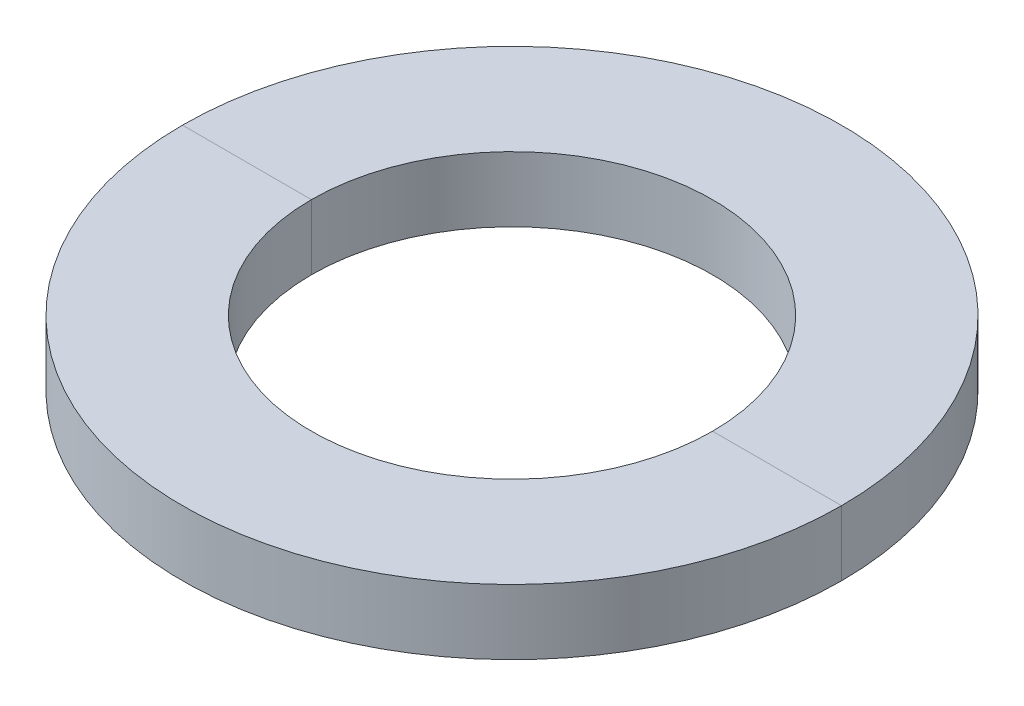
ISO-10303-21;
HEADER;
FILE_DESCRIPTION(('STEP AP214'),'2;1');
FILE_NAME('part.step','',(''),(''),'','','');
FILE_SCHEMA(('AUTOMOTIVE_DESIGN { 1 0 10303 214 1 1 1 1 }'));
ENDSEC;
DATA;
#1=APPLICATION_CONTEXT('core data for automotive mechanical design processes');
#2=APPLICATION_PROTOCOL_DEFINITION('international standard','automotive_design',2000,#1);
#3=PRODUCT_CONTEXT('',#1,'mechanical');
#4=PRODUCT('Part','Part','',(#3));
#5=PRODUCT_RELATED_PRODUCT_CATEGORY('part','',(#4));
#6=PRODUCT_DEFINITION_FORMATION('','',#4);
#7=PRODUCT_DEFINITION_CONTEXT('part definition',#1,'design');
#8=PRODUCT_DEFINITION('design','',#6,#7);
#9=PRODUCT_DEFINITION_SHAPE('','',#8);
#10=(LENGTH_UNIT() NAMED_UNIT(*) SI_UNIT(.MILLI.,.METRE.));
#11=(NAMED_UNIT(*) PLANE_ANGLE_UNIT() SI_UNIT($,.RADIAN.));
#12=(NAMED_UNIT(*) SI_UNIT($,.STERADIAN.) SOLID_ANGLE_UNIT());
#13=UNCERTAINTY_MEASURE_WITH_UNIT(LENGTH_MEASURE(1.E-05),#10,'distance_accuracy_value','');
#14=(GEOMETRIC_REPRESENTATION_CONTEXT(3) GLOBAL_UNCERTAINTY_ASSIGNED_CONTEXT((#13)) GLOBAL_UNIT_ASSIGNED_CONTEXT((#10,
#11,#12)) REPRESENTATION_CONTEXT('',''));
#15=CARTESIAN_POINT('',(0.,0.,0.));
#16=DIRECTION('',(0.,0.,1.));
#17=DIRECTION('',(1.,0.,0.));
#18=AXIS2_PLACEMENT_3D('',#15,#16,#17);
#19=CARTESIAN_POINT('',(0.,0.,0.));
#20=DIRECTION('',(0.,0.,1.));
#21=DIRECTION('',(1.,0.,0.));
#22=AXIS2_PLACEMENT_3D('',#19,#20,#21);
#23=PLANE('',#22);
#24=DIRECTION('',(1.,0.,0.));
#25=VECTOR('',#24,1.);
#26=CARTESIAN_POINT('',(0.,3.6068,0.));
#27=LINE('',#26,#25);
#28=CARTESIAN_POINT('',(-18.25625,3.6068,0.));
#29=VERTEX_POINT('',#28);
#30=CARTESIAN_POINT('',(-11.1125,3.6068,0.));
#31=VERTEX_POINT('',#30);
#32=EDGE_CURVE('E427',#29,#31,#27,.T.);
#33=ORIENTED_EDGE('',*,*,#32,.F.);
#34=DIRECTION('',(0.,-1.,0.));
#35=VECTOR('',#34,1.);
#36=CARTESIAN_POINT('',(-18.25625,3.6068,0.));
#37=LINE('',#36,#35);
#38=CARTESIAN_POINT('',(-18.25625,0.,0.));
#39=VERTEX_POINT('',#38);
#40=EDGE_CURVE('E419',#29,#39,#37,.T.);
#41=ORIENTED_EDGE('',*,*,#40,.T.);
#42=DIRECTION('',(1.,0.,0.));
#43=VECTOR('',#42,1.);
#44=CARTESIAN_POINT('',(0.,0.,0.));
#45=LINE('',#44,#43);
#46=CARTESIAN_POINT('',(-11.1125,0.,0.));
#47=VERTEX_POINT('',#46);
#48=EDGE_CURVE('E439',#39,#47,#45,.T.);
#49=ORIENTED_EDGE('',*,*,#48,.T.);
#50=DIRECTION('',(0.,-1.,0.));
#51=VECTOR('',#50,1.);
#52=CARTESIAN_POINT('',(-11.1125,3.6068,0.));
#53=LINE('',#52,#51);
#54=EDGE_CURVE('E393',#31,#47,#53,.T.);
#55=ORIENTED_EDGE('',*,*,#54,.F.);
#56=EDGE_LOOP('',(#33,#41,#49,#55));
#57=FACE_BOUND('',#56,.T.);
#58=ADVANCED_FACE('F370',(#57),#23,.T.);
#59=CARTESIAN_POINT('',(11.1125,0.,0.));
#60=VERTEX_POINT('',#59);
#61=CARTESIAN_POINT('',(18.25625,0.,0.));
#62=VERTEX_POINT('',#61);
#63=EDGE_CURVE('E432',#60,#62,#45,.T.);
#64=ORIENTED_EDGE('',*,*,#63,.T.);
#65=DIRECTION('',(0.,-1.,0.));
#66=VECTOR('',#65,1.);
#67=CARTESIAN_POINT('',(18.25625,3.6068,0.));
#68=LINE('',#67,#66);
#69=CARTESIAN_POINT('',(18.25625,3.6068,0.));
#70=VERTEX_POINT('',#69);
#71=EDGE_CURVE('E417',#62,#70,#68,.F.);
#72=ORIENTED_EDGE('',*,*,#71,.T.);
#73=CARTESIAN_POINT('',(11.1125,3.6068,0.));
#74=VERTEX_POINT('',#73);
#75=EDGE_CURVE('E424',#74,#70,#27,.T.);
#76=ORIENTED_EDGE('',*,*,#75,.F.);
#77=DIRECTION('',(0.,-1.,0.));
#78=VECTOR('',#77,1.);
#79=CARTESIAN_POINT('',(11.1125,3.6068,0.));
#80=LINE('',#79,#78);
#81=EDGE_CURVE('E385',#60,#74,#80,.F.);
#82=ORIENTED_EDGE('',*,*,#81,.F.);
#83=EDGE_LOOP('',(#64,#72,#76,#82));
#84=FACE_BOUND('',#83,.T.);
#85=ADVANCED_FACE('F430',(#84),#23,.T.);
#86=CARTESIAN_POINT('',(0.,3.6068,0.));
#87=DIRECTION('',(0.,-1.,0.));
#88=DIRECTION('',(0.,0.,-1.));
#89=AXIS2_PLACEMENT_3D('',#86,#87,#88);
#90=CYLINDRICAL_SURFACE('',#89,11.1125);
#91=CARTESIAN_POINT('',(0.,3.6068,0.));
#92=DIRECTION('',(0.,1.,0.));
#93=DIRECTION('',(0.,0.,1.));
#94=AXIS2_PLACEMENT_3D('',#91,#92,#93);
#95=CIRCLE('',#94,11.1125);
#96=EDGE_CURVE('E378',#74,#31,#95,.T.);
#97=ORIENTED_EDGE('',*,*,#96,.T.);
#98=ORIENTED_EDGE('',*,*,#54,.T.);
#99=CARTESIAN_POINT('',(0.,0.,0.));
#100=DIRECTION('',(0.,1.,0.));
#101=DIRECTION('',(0.,0.,1.));
#102=AXIS2_PLACEMENT_3D('',#99,#100,#101);
#103=CIRCLE('',#102,11.1125);
#104=EDGE_CURVE('E12',#60,#47,#103,.T.);
#105=ORIENTED_EDGE('',*,*,#104,.F.);
#106=ORIENTED_EDGE('',*,*,#81,.T.);
#107=EDGE_LOOP('',(#97,#98,#105,#106));
#108=FACE_BOUND('',#107,.T.);
#109=ADVANCED_FACE('F372',(#108),#90,.F.);
#110=CARTESIAN_POINT('',(0.,3.6068,0.));
#111=DIRECTION('',(0.,-1.,0.));
#112=DIRECTION('',(0.,0.,-1.));
#113=AXIS2_PLACEMENT_3D('',#110,#111,#112);
#114=CYLINDRICAL_SURFACE('',#113,18.25625);
#115=ORIENTED_EDGE('',*,*,#40,.F.);
#116=CARTESIAN_POINT('',(0.,3.6068,0.));
#117=DIRECTION('',(0.,1.,0.));
#118=DIRECTION('',(0.,0.,1.));
#119=AXIS2_PLACEMENT_3D('',#116,#117,#118);
#120=CIRCLE('',#119,18.25625);
#121=EDGE_CURVE('E413',#70,#29,#120,.T.);
#122=ORIENTED_EDGE('',*,*,#121,.F.);
#123=ORIENTED_EDGE('',*,*,#71,.F.);
#124=CARTESIAN_POINT('',(0.,0.,0.));
#125=DIRECTION('',(0.,1.,0.));
#126=DIRECTION('',(0.,0.,1.));
#127=AXIS2_PLACEMENT_3D('',#124,#125,#126);
#128=CIRCLE('',#127,18.25625);
#129=EDGE_CURVE('E421',#62,#39,#128,.T.);
#130=ORIENTED_EDGE('',*,*,#129,.T.);
#131=EDGE_LOOP('',(#115,#122,#123,#130));
#132=FACE_BOUND('',#131,.T.);
#133=ADVANCED_FACE('F415',(#132),#114,.T.);
#134=CARTESIAN_POINT('',(0.,0.,0.));
#135=DIRECTION('',(0.,1.,0.));
#136=DIRECTION('',(0.,0.,1.));
#137=AXIS2_PLACEMENT_3D('',#134,#135,#136);
#138=PLANE('',#137);
#139=ORIENTED_EDGE('',*,*,#48,.F.);
#140=ORIENTED_EDGE('',*,*,#129,.F.);
#141=ORIENTED_EDGE('',*,*,#63,.F.);
#142=ORIENTED_EDGE('',*,*,#104,.T.);
#143=EDGE_LOOP('',(#139,#140,#141,#142));
#144=FACE_BOUND('',#143,.T.);
#145=ADVANCED_FACE('F441',(#144),#138,.F.);
#146=CARTESIAN_POINT('',(0.,3.6068,0.));
#147=DIRECTION('',(0.,1.,0.));
#148=DIRECTION('',(0.,0.,1.));
#149=AXIS2_PLACEMENT_3D('',#146,#147,#148);
#150=PLANE('',#149);
#151=ORIENTED_EDGE('',*,*,#121,.T.);
#152=ORIENTED_EDGE('',*,*,#32,.T.);
#153=ORIENTED_EDGE('',*,*,#96,.F.);
#154=ORIENTED_EDGE('',*,*,#75,.T.);
#155=EDGE_LOOP('',(#151,#152,#153,#154));
#156=FACE_BOUND('',#155,.T.);
#157=ADVANCED_FACE('F425',(#156),#150,.T.);
#158=CLOSED_SHELL('',(#58,#85,#109,#133,#145,#157));
#159=MANIFOLD_SOLID_BREP('B2',#158);
#160=CARTESIAN_POINT('',(0.,0.,0.));
#161=DIRECTION('',(0.,0.,1.));
#162=DIRECTION('',(1.,0.,0.));
#163=AXIS2_PLACEMENT_3D('',#160,#161,#162);
#164=PLANE('',#163);
#165=DIRECTION('',(1.,0.,0.));
#166=VECTOR('',#165,1.);
#167=CARTESIAN_POINT('',(0.,3.6068,0.));
#168=LINE('',#167,#166);
#169=CARTESIAN_POINT('',(-18.25625,3.6068,0.));
#170=VERTEX_POINT('',#169);
#171=CARTESIAN_POINT('',(-11.1125,3.6068,0.));
#172=VERTEX_POINT('',#171);
#173=EDGE_CURVE('E532',#170,#172,#168,.T.);
#174=ORIENTED_EDGE('',*,*,#173,.T.);
#175=DIRECTION('',(0.,-1.,0.));
#176=VECTOR('',#175,1.);
#177=CARTESIAN_POINT('',(-11.1125,3.6068,0.));
#178=LINE('',#177,#176);
#179=CARTESIAN_POINT('',(-11.1125,0.,0.));
#180=VERTEX_POINT('',#179);
#181=EDGE_CURVE('E483',#172,#180,#178,.T.);
#182=ORIENTED_EDGE('',*,*,#181,.T.);
#183=DIRECTION('',(1.,0.,0.));
#184=VECTOR('',#183,1.);
#185=CARTESIAN_POINT('',(0.,0.,0.));
#186=LINE('',#185,#184);
#187=CARTESIAN_POINT('',(-18.25625,0.,0.));
#188=VERTEX_POINT('',#187);
#189=EDGE_CURVE('E546',#188,#180,#186,.T.);
#190=ORIENTED_EDGE('',*,*,#189,.F.);
#191=DIRECTION('',(0.,-1.,0.));
#192=VECTOR('',#191,1.);
#193=CARTESIAN_POINT('',(-18.25625,3.6068,0.));
#194=LINE('',#193,#192);
#195=EDGE_CURVE('E529',#170,#188,#194,.T.);
#196=ORIENTED_EDGE('',*,*,#195,.F.);
#197=EDGE_LOOP('',(#174,#182,#190,#196));
#198=FACE_BOUND('',#197,.T.);
#199=ADVANCED_FACE('F479',(#198),#164,.F.);
#200=CARTESIAN_POINT('',(11.1125,0.,0.));
#201=VERTEX_POINT('',#200);
#202=CARTESIAN_POINT('',(18.25625,0.,0.));
#203=VERTEX_POINT('',#202);
#204=EDGE_CURVE('E544',#201,#203,#186,.T.);
#205=ORIENTED_EDGE('',*,*,#204,.F.);
#206=DIRECTION('',(0.,-1.,0.));
#207=VECTOR('',#206,1.);
#208=CARTESIAN_POINT('',(11.1125,3.6068,0.));
#209=LINE('',#208,#207);
#210=CARTESIAN_POINT('',(11.1125,3.6068,0.));
#211=VERTEX_POINT('',#210);
#212=EDGE_CURVE('E368',#201,#211,#209,.F.);
#213=ORIENTED_EDGE('',*,*,#212,.T.);
#214=CARTESIAN_POINT('',(18.25625,3.6068,0.));
#215=VERTEX_POINT('',#214);
#216=EDGE_CURVE('E494',#211,#215,#168,.T.);
#217=ORIENTED_EDGE('',*,*,#216,.T.);
#218=DIRECTION('',(0.,-1.,0.));
#219=VECTOR('',#218,1.);
#220=CARTESIAN_POINT('',(18.25625,3.6068,0.));
#221=LINE('',#220,#219);
#222=EDGE_CURVE('E522',#203,#215,#221,.F.);
#223=ORIENTED_EDGE('',*,*,#222,.F.);
#224=EDGE_LOOP('',(#205,#213,#217,#223));
#225=FACE_BOUND('',#224,.T.);
#226=ADVANCED_FACE('F531',(#225),#164,.F.);
#227=CARTESIAN_POINT('',(0.,3.6068,0.));
#228=DIRECTION('',(0.,1.,0.));
#229=DIRECTION('',(0.,0.,1.));
#230=AXIS2_PLACEMENT_3D('',#227,#228,#229);
#231=PLANE('',#230);
#232=ORIENTED_EDGE('',*,*,#173,.F.);
#233=CARTESIAN_POINT('',(0.,3.6068,0.));
#234=DIRECTION('',(0.,1.,0.));
#235=DIRECTION('',(0.,0.,1.));
#236=AXIS2_PLACEMENT_3D('',#233,#234,#235);
#237=CIRCLE('',#236,18.25625);
#238=EDGE_CURVE('E523',#170,#215,#237,.T.);
#239=ORIENTED_EDGE('',*,*,#238,.T.);
#240=ORIENTED_EDGE('',*,*,#216,.F.);
#241=CARTESIAN_POINT('',(0.,3.6068,0.));
#242=DIRECTION('',(0.,1.,0.));
#243=DIRECTION('',(0.,0.,1.));
#244=AXIS2_PLACEMENT_3D('',#241,#242,#243);
#245=CIRCLE('',#244,11.1125);
#246=EDGE_CURVE('E537',#172,#211,#245,.T.);
#247=ORIENTED_EDGE('',*,*,#246,.F.);
#248=EDGE_LOOP('',(#232,#239,#240,#247));
#249=FACE_BOUND('',#248,.T.);
#250=ADVANCED_FACE('F535',(#249),#231,.T.);
#251=CARTESIAN_POINT('',(0.,0.,0.));
#252=DIRECTION('',(0.,1.,0.));
#253=DIRECTION('',(0.,0.,1.));
#254=AXIS2_PLACEMENT_3D('',#251,#252,#253);
#255=PLANE('',#254);
#256=CARTESIAN_POINT('',(0.,0.,0.));
#257=DIRECTION('',(0.,1.,0.));
#258=DIRECTION('',(0.,0.,1.));
#259=AXIS2_PLACEMENT_3D('',#256,#257,#258);
#260=CIRCLE('',#259,18.25625);
#261=EDGE_CURVE('E525',#188,#203,#260,.T.);
#262=ORIENTED_EDGE('',*,*,#261,.F.);
#263=ORIENTED_EDGE('',*,*,#189,.T.);
#264=CARTESIAN_POINT('',(0.,0.,0.));
#265=DIRECTION('',(0.,1.,0.));
#266=DIRECTION('',(0.,0.,1.));
#267=AXIS2_PLACEMENT_3D('',#264,#265,#266);
#268=CIRCLE('',#267,11.1125);
#269=EDGE_CURVE('E541',#180,#201,#268,.T.);
#270=ORIENTED_EDGE('',*,*,#269,.T.);
#271=ORIENTED_EDGE('',*,*,#204,.T.);
#272=EDGE_LOOP('',(#262,#263,#270,#271));
#273=FACE_BOUND('',#272,.T.);
#274=ADVANCED_FACE('F549',(#273),#255,.F.);
#275=CARTESIAN_POINT('',(0.,3.6068,0.));
#276=DIRECTION('',(0.,-1.,0.));
#277=DIRECTION('',(0.,0.,-1.));
#278=AXIS2_PLACEMENT_3D('',#275,#276,#277);
#279=CYLINDRICAL_SURFACE('',#278,18.25625);
#280=ORIENTED_EDGE('',*,*,#238,.F.);
#281=ORIENTED_EDGE('',*,*,#195,.T.);
#282=ORIENTED_EDGE('',*,*,#261,.T.);
#283=ORIENTED_EDGE('',*,*,#222,.T.);
#284=EDGE_LOOP('',(#280,#281,#282,#283));
#285=FACE_BOUND('',#284,.T.);
#286=ADVANCED_FACE('F481',(#285),#279,.T.);
#287=CARTESIAN_POINT('',(0.,3.6068,0.));
#288=DIRECTION('',(0.,-1.,0.));
#289=DIRECTION('',(0.,0.,-1.));
#290=AXIS2_PLACEMENT_3D('',#287,#288,#289);
#291=CYLINDRICAL_SURFACE('',#290,11.1125);
#292=ORIENTED_EDGE('',*,*,#181,.F.);
#293=ORIENTED_EDGE('',*,*,#246,.T.);
#294=ORIENTED_EDGE('',*,*,#212,.F.);
#295=ORIENTED_EDGE('',*,*,#269,.F.);
#296=EDGE_LOOP('',(#292,#293,#294,#295));
#297=FACE_BOUND('',#296,.T.);
#298=ADVANCED_FACE('F550',(#297),#291,.F.);
#299=CLOSED_SHELL('',(#199,#226,#250,#274,#286,#298));
#300=MANIFOLD_SOLID_BREP('B6',#299);
#301=ADVANCED_BREP_SHAPE_REPRESENTATION('',(#18,#159,#300),#14);
#302=SHAPE_DEFINITION_REPRESENTATION(#9,#301);
ENDSEC;
END-ISO-10303-21;
